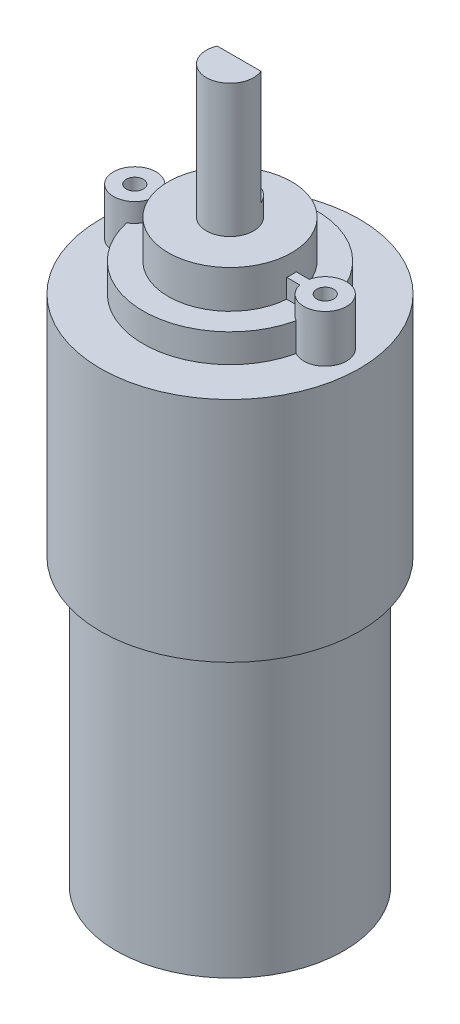
ISO-10303-21;
HEADER;
FILE_DESCRIPTION(('STEP AP214'),'2;1');
FILE_NAME('part.step','',(''),(''),'','','');
FILE_SCHEMA(('AUTOMOTIVE_DESIGN { 1 0 10303 214 1 1 1 1 }'));
ENDSEC;
DATA;
#1=APPLICATION_CONTEXT('core data for automotive mechanical design processes');
#2=APPLICATION_PROTOCOL_DEFINITION('international standard','automotive_design',2000,#1);
#3=PRODUCT_CONTEXT('',#1,'mechanical');
#4=PRODUCT('Part','Part','',(#3));
#5=PRODUCT_RELATED_PRODUCT_CATEGORY('part','',(#4));
#6=PRODUCT_DEFINITION_FORMATION('','',#4);
#7=PRODUCT_DEFINITION_CONTEXT('part definition',#1,'design');
#8=PRODUCT_DEFINITION('design','',#6,#7);
#9=PRODUCT_DEFINITION_SHAPE('','',#8);
#10=(LENGTH_UNIT() NAMED_UNIT(*) SI_UNIT(.MILLI.,.METRE.));
#11=(NAMED_UNIT(*) PLANE_ANGLE_UNIT() SI_UNIT($,.RADIAN.));
#12=(NAMED_UNIT(*) SI_UNIT($,.STERADIAN.) SOLID_ANGLE_UNIT());
#13=UNCERTAINTY_MEASURE_WITH_UNIT(LENGTH_MEASURE(1.E-05),#10,'distance_accuracy_value','');
#14=(GEOMETRIC_REPRESENTATION_CONTEXT(3) GLOBAL_UNCERTAINTY_ASSIGNED_CONTEXT((#13)) GLOBAL_UNIT_ASSIGNED_CONTEXT((#10,
#11,#12)) REPRESENTATION_CONTEXT('',''));
#15=CARTESIAN_POINT('',(0.,0.,0.));
#16=DIRECTION('',(0.,0.,1.));
#17=DIRECTION('',(1.,0.,0.));
#18=AXIS2_PLACEMENT_3D('',#15,#16,#17);
#19=CARTESIAN_POINT('',(0.,26.5,0.));
#20=DIRECTION('',(0.,1.,0.));
#21=DIRECTION('',(0.,0.,1.));
#22=AXIS2_PLACEMENT_3D('',#19,#20,#21);
#23=PLANE('',#22);
#24=DIRECTION('',(1.,0.,0.));
#25=VECTOR('',#24,1.);
#26=CARTESIAN_POINT('',(0.,26.5,0.500000000000004));
#27=LINE('',#26,#25);
#28=CARTESIAN_POINT('',(6.48074069840786,26.5,0.500000000000004));
#29=VERTEX_POINT('',#28);
#30=CARTESIAN_POINT('',(7.84625890315197,26.5,0.500000000000004));
#31=VERTEX_POINT('',#30);
#32=EDGE_CURVE('E169',#29,#31,#27,.T.);
#33=ORIENTED_EDGE('',*,*,#32,.F.);
#34=CARTESIAN_POINT('',(0.,26.5,0.));
#35=DIRECTION('',(0.,1.,0.));
#36=DIRECTION('',(0.,0.,1.));
#37=AXIS2_PLACEMENT_3D('',#34,#35,#36);
#38=CIRCLE('',#37,6.5);
#39=CARTESIAN_POINT('',(-6.48074069840786,26.5,0.500000000000004));
#40=VERTEX_POINT('',#39);
#41=EDGE_CURVE('E324',#40,#29,#38,.T.);
#42=ORIENTED_EDGE('',*,*,#41,.F.);
#43=CARTESIAN_POINT('',(-7.84625890315197,26.5,0.500000000000004));
#44=VERTEX_POINT('',#43);
#45=EDGE_CURVE('E359',#44,#40,#27,.T.);
#46=ORIENTED_EDGE('',*,*,#45,.F.);
#47=CARTESIAN_POINT('',(-10.04,26.5,0.));
#48=DIRECTION('',(0.,1.,0.));
#49=DIRECTION('',(0.,0.,1.));
#50=AXIS2_PLACEMENT_3D('',#47,#48,#49);
#51=CIRCLE('',#50,2.25);
#52=CARTESIAN_POINT('',(-8.93733067729084,26.5,1.96128028714819));
#53=VERTEX_POINT('',#52);
#54=EDGE_CURVE('E241',#44,#53,#51,.F.);
#55=ORIENTED_EDGE('',*,*,#54,.T.);
#56=CARTESIAN_POINT('',(0.,26.5,0.));
#57=DIRECTION('',(0.,1.,0.));
#58=DIRECTION('',(0.,0.,1.));
#59=AXIS2_PLACEMENT_3D('',#56,#57,#58);
#60=CIRCLE('',#59,9.15);
#61=CARTESIAN_POINT('',(8.93733067729083,26.5,1.9612802871482));
#62=VERTEX_POINT('',#61);
#63=EDGE_CURVE('E318',#53,#62,#60,.T.);
#64=ORIENTED_EDGE('',*,*,#63,.T.);
#65=CARTESIAN_POINT('',(10.04,26.5,0.));
#66=DIRECTION('',(0.,1.,0.));
#67=DIRECTION('',(0.,0.,1.));
#68=AXIS2_PLACEMENT_3D('',#65,#66,#67);
#69=CIRCLE('',#68,2.25);
#70=EDGE_CURVE('E261',#31,#62,#69,.T.);
#71=ORIENTED_EDGE('',*,*,#70,.F.);
#72=EDGE_LOOP('',(#33,#42,#46,#55,#64,#71));
#73=FACE_BOUND('',#72,.T.);
#74=ADVANCED_FACE('F41',(#73),#23,.T.);
#75=CARTESIAN_POINT('',(8.93733067729083,26.5,-1.9612802871482));
#76=VERTEX_POINT('',#75);
#77=CARTESIAN_POINT('',(7.84625890315197,26.5,-0.499999999999999));
#78=VERTEX_POINT('',#77);
#79=EDGE_CURVE('E265',#76,#78,#69,.T.);
#80=ORIENTED_EDGE('',*,*,#79,.F.);
#81=CARTESIAN_POINT('',(-8.93733067729083,26.5,-1.9612802871482));
#82=VERTEX_POINT('',#81);
#83=EDGE_CURVE('E386',#76,#82,#60,.T.);
#84=ORIENTED_EDGE('',*,*,#83,.T.);
#85=CARTESIAN_POINT('',(-7.84625890315197,26.5,-0.499999999999999));
#86=VERTEX_POINT('',#85);
#87=EDGE_CURVE('E236',#82,#86,#51,.F.);
#88=ORIENTED_EDGE('',*,*,#87,.T.);
#89=DIRECTION('',(1.,0.,0.));
#90=VECTOR('',#89,1.);
#91=CARTESIAN_POINT('',(0.,26.5,-0.499999999999999));
#92=LINE('',#91,#90);
#93=CARTESIAN_POINT('',(-6.48074069840786,26.5,-0.499999999999999));
#94=VERTEX_POINT('',#93);
#95=EDGE_CURVE('E356',#86,#94,#92,.T.);
#96=ORIENTED_EDGE('',*,*,#95,.T.);
#97=CARTESIAN_POINT('',(6.48074069840786,26.5,-0.499999999999999));
#98=VERTEX_POINT('',#97);
#99=EDGE_CURVE('E327',#98,#94,#38,.T.);
#100=ORIENTED_EDGE('',*,*,#99,.F.);
#101=EDGE_CURVE('E360',#98,#78,#92,.T.);
#102=ORIENTED_EDGE('',*,*,#101,.T.);
#103=EDGE_LOOP('',(#80,#84,#88,#96,#100,#102));
#104=FACE_BOUND('',#103,.T.);
#105=ADVANCED_FACE('F371',(#104),#23,.T.);
#106=CARTESIAN_POINT('',(0.,65.6871565633395,0.));
#107=DIRECTION('',(0.,1.,0.));
#108=DIRECTION('',(0.,0.,1.));
#109=AXIS2_PLACEMENT_3D('',#106,#107,#108);
#110=CYLINDRICAL_SURFACE('',#109,9.15);
#111=DIRECTION('',(0.,-1.,0.));
#112=VECTOR('',#111,1.);
#113=CARTESIAN_POINT('',(8.93733067729083,25.,-1.9612802871482));
#114=LINE('',#113,#112);
#115=CARTESIAN_POINT('',(8.93733067729083,23.5,-1.9612802871482));
#116=VERTEX_POINT('',#115);
#117=EDGE_CURVE('E264',#116,#76,#114,.F.);
#118=ORIENTED_EDGE('',*,*,#117,.F.);
#119=CARTESIAN_POINT('',(0.,23.5,0.));
#120=DIRECTION('',(0.,1.,0.));
#121=DIRECTION('',(0.,0.,1.));
#122=AXIS2_PLACEMENT_3D('',#119,#120,#121);
#123=CIRCLE('',#122,9.15);
#124=CARTESIAN_POINT('',(-8.93733067729083,23.5,-1.9612802871482));
#125=VERTEX_POINT('',#124);
#126=EDGE_CURVE('E392',#116,#125,#123,.T.);
#127=ORIENTED_EDGE('',*,*,#126,.T.);
#128=DIRECTION('',(0.,-1.,0.));
#129=VECTOR('',#128,1.);
#130=CARTESIAN_POINT('',(-8.93733067729083,25.,-1.9612802871482));
#131=LINE('',#130,#129);
#132=EDGE_CURVE('E232',#125,#82,#131,.F.);
#133=ORIENTED_EDGE('',*,*,#132,.T.);
#134=ORIENTED_EDGE('',*,*,#83,.F.);
#135=EDGE_LOOP('',(#118,#127,#133,#134));
#136=FACE_BOUND('',#135,.T.);
#137=ADVANCED_FACE('F435',(#136),#110,.T.);
#138=DIRECTION('',(0.,-1.,0.));
#139=VECTOR('',#138,1.);
#140=CARTESIAN_POINT('',(8.93733067729083,25.,1.9612802871482));
#141=LINE('',#140,#139);
#142=CARTESIAN_POINT('',(8.93733067729083,23.5,1.9612802871482));
#143=VERTEX_POINT('',#142);
#144=EDGE_CURVE('E257',#62,#143,#141,.T.);
#145=ORIENTED_EDGE('',*,*,#144,.F.);
#146=ORIENTED_EDGE('',*,*,#63,.F.);
#147=DIRECTION('',(0.,-1.,0.));
#148=VECTOR('',#147,1.);
#149=CARTESIAN_POINT('',(-8.93733067729083,25.,1.9612802871482));
#150=LINE('',#149,#148);
#151=CARTESIAN_POINT('',(-8.93733067729083,23.5,1.9612802871482));
#152=VERTEX_POINT('',#151);
#153=EDGE_CURVE('E240',#53,#152,#150,.T.);
#154=ORIENTED_EDGE('',*,*,#153,.T.);
#155=EDGE_CURVE('E312',#152,#143,#123,.T.);
#156=ORIENTED_EDGE('',*,*,#155,.T.);
#157=EDGE_LOOP('',(#145,#146,#154,#156));
#158=FACE_BOUND('',#157,.T.);
#159=ADVANCED_FACE('F404',(#158),#110,.T.);
#160=CARTESIAN_POINT('',(0.,23.5,0.));
#161=DIRECTION('',(0.,1.,0.));
#162=DIRECTION('',(0.,0.,1.));
#163=AXIS2_PLACEMENT_3D('',#160,#161,#162);
#164=PLANE('',#163);
#165=CARTESIAN_POINT('',(0.,23.5,0.));
#166=DIRECTION('',(0.,1.,0.));
#167=DIRECTION('',(0.,0.,1.));
#168=AXIS2_PLACEMENT_3D('',#165,#166,#167);
#169=CIRCLE('',#168,13.65);
#170=CARTESIAN_POINT('',(0.,23.5,13.65));
#171=VERTEX_POINT('',#170);
#172=EDGE_CURVE('E308',#171,#171,#169,.T.);
#173=ORIENTED_EDGE('',*,*,#172,.T.);
#174=EDGE_LOOP('',(#173));
#175=FACE_BOUND('',#174,.T.);
#176=CARTESIAN_POINT('',(10.04,23.5,0.));
#177=DIRECTION('',(0.,1.,0.));
#178=DIRECTION('',(0.,0.,1.));
#179=AXIS2_PLACEMENT_3D('',#176,#177,#178);
#180=CIRCLE('',#179,2.25);
#181=EDGE_CURVE('E352',#143,#116,#180,.T.);
#182=ORIENTED_EDGE('',*,*,#181,.F.);
#183=ORIENTED_EDGE('',*,*,#155,.F.);
#184=CARTESIAN_POINT('',(-10.04,23.5,0.));
#185=DIRECTION('',(0.,1.,0.));
#186=DIRECTION('',(0.,0.,1.));
#187=AXIS2_PLACEMENT_3D('',#184,#185,#186);
#188=CIRCLE('',#187,2.25);
#189=EDGE_CURVE('E344',#152,#125,#188,.F.);
#190=ORIENTED_EDGE('',*,*,#189,.T.);
#191=ORIENTED_EDGE('',*,*,#126,.F.);
#192=EDGE_LOOP('',(#182,#183,#190,#191));
#193=FACE_BOUND('',#192,.T.);
#194=ADVANCED_FACE('F465',(#175,#193),#164,.T.);
#195=CARTESIAN_POINT('',(0.,44.5,0.));
#196=DIRECTION('',(0.,1.,0.));
#197=DIRECTION('',(0.,0.,1.));
#198=AXIS2_PLACEMENT_3D('',#195,#196,#197);
#199=PLANE('',#198);
#200=DIRECTION('',(1.,0.,0.));
#201=VECTOR('',#200,1.);
#202=CARTESIAN_POINT('',(0.,44.5,-0.96));
#203=LINE('',#202,#201);
#204=CARTESIAN_POINT('',(-2.30833273164854,44.5,-0.96));
#205=VERTEX_POINT('',#204);
#206=CARTESIAN_POINT('',(2.30833273164854,44.5,-0.96));
#207=VERTEX_POINT('',#206);
#208=EDGE_CURVE('E280',#205,#207,#203,.T.);
#209=ORIENTED_EDGE('',*,*,#208,.F.);
#210=CARTESIAN_POINT('',(0.,44.5,0.));
#211=DIRECTION('',(0.,1.,0.));
#212=DIRECTION('',(0.,0.,1.));
#213=AXIS2_PLACEMENT_3D('',#210,#211,#212);
#214=CIRCLE('',#213,2.5);
#215=EDGE_CURVE('E336',#205,#207,#214,.T.);
#216=ORIENTED_EDGE('',*,*,#215,.T.);
#217=EDGE_LOOP('',(#209,#216));
#218=FACE_BOUND('',#217,.T.);
#219=ADVANCED_FACE('F43',(#218),#199,.T.);
#220=CARTESIAN_POINT('',(0.,65.6871565633395,0.));
#221=DIRECTION('',(0.,1.,0.));
#222=DIRECTION('',(0.,0.,1.));
#223=AXIS2_PLACEMENT_3D('',#220,#221,#222);
#224=CYLINDRICAL_SURFACE('',#223,2.5);
#225=DIRECTION('',(0.,1.,0.));
#226=VECTOR('',#225,1.);
#227=CARTESIAN_POINT('',(2.30833273164854,32.5,-0.96));
#228=LINE('',#227,#226);
#229=CARTESIAN_POINT('',(2.30833273164854,32.5,-0.96));
#230=VERTEX_POINT('',#229);
#231=EDGE_CURVE('E290',#230,#207,#228,.T.);
#232=ORIENTED_EDGE('',*,*,#231,.T.);
#233=ORIENTED_EDGE('',*,*,#215,.F.);
#234=DIRECTION('',(0.,1.,0.));
#235=VECTOR('',#234,1.);
#236=CARTESIAN_POINT('',(-2.30833273164854,32.5,-0.96));
#237=LINE('',#236,#235);
#238=CARTESIAN_POINT('',(-2.30833273164854,32.5,-0.96));
#239=VERTEX_POINT('',#238);
#240=EDGE_CURVE('E287',#239,#205,#237,.T.);
#241=ORIENTED_EDGE('',*,*,#240,.F.);
#242=CARTESIAN_POINT('',(0.,32.5,0.));
#243=DIRECTION('',(0.,1.,0.));
#244=DIRECTION('',(0.,0.,1.));
#245=AXIS2_PLACEMENT_3D('',#242,#243,#244);
#246=CIRCLE('',#245,2.5);
#247=EDGE_CURVE('E281',#230,#239,#246,.T.);
#248=ORIENTED_EDGE('',*,*,#247,.F.);
#249=EDGE_LOOP('',(#232,#233,#241,#248));
#250=FACE_BOUND('',#249,.T.);
#251=CARTESIAN_POINT('',(0.,30.5,0.));
#252=DIRECTION('',(0.,1.,0.));
#253=DIRECTION('',(0.,0.,1.));
#254=AXIS2_PLACEMENT_3D('',#251,#252,#253);
#255=CIRCLE('',#254,2.5);
#256=CARTESIAN_POINT('',(0.,30.5,2.5));
#257=VERTEX_POINT('',#256);
#258=EDGE_CURVE('E332',#257,#257,#255,.T.);
#259=ORIENTED_EDGE('',*,*,#258,.T.);
#260=EDGE_LOOP('',(#259));
#261=FACE_BOUND('',#260,.T.);
#262=ADVANCED_FACE('F541',(#250,#261),#224,.T.);
#263=CARTESIAN_POINT('',(0.,30.5,0.));
#264=DIRECTION('',(0.,1.,0.));
#265=DIRECTION('',(0.,0.,1.));
#266=AXIS2_PLACEMENT_3D('',#263,#264,#265);
#267=PLANE('',#266);
#268=CARTESIAN_POINT('',(0.,30.5,0.));
#269=DIRECTION('',(0.,1.,0.));
#270=DIRECTION('',(0.,0.,1.));
#271=AXIS2_PLACEMENT_3D('',#268,#269,#270);
#272=CIRCLE('',#271,6.5);
#273=CARTESIAN_POINT('',(0.,30.5,6.5));
#274=VERTEX_POINT('',#273);
#275=EDGE_CURVE('E328',#274,#274,#272,.T.);
#276=ORIENTED_EDGE('',*,*,#275,.T.);
#277=EDGE_LOOP('',(#276));
#278=FACE_BOUND('',#277,.T.);
#279=ORIENTED_EDGE('',*,*,#258,.F.);
#280=EDGE_LOOP('',(#279));
#281=FACE_BOUND('',#280,.T.);
#282=ADVANCED_FACE('F518',(#278,#281),#267,.T.);
#283=CARTESIAN_POINT('',(0.,65.6871565633395,0.));
#284=DIRECTION('',(0.,1.,0.));
#285=DIRECTION('',(0.,0.,1.));
#286=AXIS2_PLACEMENT_3D('',#283,#284,#285);
#287=CYLINDRICAL_SURFACE('',#286,6.5);
#288=DIRECTION('',(0.,1.,0.));
#289=VECTOR('',#288,1.);
#290=CARTESIAN_POINT('',(-6.48074069840786,65.6871565633395,0.500000000000004));
#291=LINE('',#290,#289);
#292=CARTESIAN_POINT('',(-6.48074069840786,28.5,0.500000000000004));
#293=VERTEX_POINT('',#292);
#294=EDGE_CURVE('E277',#40,#293,#291,.T.);
#295=ORIENTED_EDGE('',*,*,#294,.F.);
#296=ORIENTED_EDGE('',*,*,#41,.T.);
#297=DIRECTION('',(0.,1.,0.));
#298=VECTOR('',#297,1.);
#299=CARTESIAN_POINT('',(6.48074069840786,65.6871565633395,0.500000000000004));
#300=LINE('',#299,#298);
#301=CARTESIAN_POINT('',(6.48074069840786,28.5,0.500000000000004));
#302=VERTEX_POINT('',#301);
#303=EDGE_CURVE('E57',#302,#29,#300,.F.);
#304=ORIENTED_EDGE('',*,*,#303,.F.);
#305=CARTESIAN_POINT('',(0.,28.5,0.));
#306=DIRECTION('',(0.,1.,0.));
#307=DIRECTION('',(0.,0.,1.));
#308=AXIS2_PLACEMENT_3D('',#305,#306,#307);
#309=CIRCLE('',#308,6.5);
#310=CARTESIAN_POINT('',(6.48074069840786,28.5,-0.499999999999999));
#311=VERTEX_POINT('',#310);
#312=EDGE_CURVE('E45',#311,#302,#309,.F.);
#313=ORIENTED_EDGE('',*,*,#312,.F.);
#314=DIRECTION('',(0.,1.,0.));
#315=VECTOR('',#314,1.);
#316=CARTESIAN_POINT('',(6.48074069840786,65.6871565633395,-0.499999999999999));
#317=LINE('',#316,#315);
#318=EDGE_CURVE('E268',#311,#98,#317,.F.);
#319=ORIENTED_EDGE('',*,*,#318,.T.);
#320=ORIENTED_EDGE('',*,*,#99,.T.);
#321=DIRECTION('',(0.,1.,0.));
#322=VECTOR('',#321,1.);
#323=CARTESIAN_POINT('',(-6.48074069840786,65.6871565633395,-0.499999999999999));
#324=LINE('',#323,#322);
#325=CARTESIAN_POINT('',(-6.48074069840786,28.5,-0.499999999999999));
#326=VERTEX_POINT('',#325);
#327=EDGE_CURVE('E271',#94,#326,#324,.T.);
#328=ORIENTED_EDGE('',*,*,#327,.T.);
#329=EDGE_CURVE('E11',#293,#326,#309,.F.);
#330=ORIENTED_EDGE('',*,*,#329,.F.);
#331=EDGE_LOOP('',(#295,#296,#304,#313,#319,#320,#328,#330));
#332=FACE_BOUND('',#331,.T.);
#333=ORIENTED_EDGE('',*,*,#275,.F.);
#334=EDGE_LOOP('',(#333));
#335=FACE_BOUND('',#334,.T.);
#336=ADVANCED_FACE('F379',(#332,#335),#287,.T.);
#337=CARTESIAN_POINT('',(0.,65.6871565633395,0.));
#338=DIRECTION('',(0.,1.,0.));
#339=DIRECTION('',(0.,0.,1.));
#340=AXIS2_PLACEMENT_3D('',#337,#338,#339);
#341=CYLINDRICAL_SURFACE('',#340,13.65);
#342=CARTESIAN_POINT('',(0.,-0.5,0.));
#343=DIRECTION('',(0.,1.,0.));
#344=DIRECTION('',(0.,0.,1.));
#345=AXIS2_PLACEMENT_3D('',#342,#343,#344);
#346=CIRCLE('',#345,13.65);
#347=CARTESIAN_POINT('',(0.,-0.5,13.65));
#348=VERTEX_POINT('',#347);
#349=EDGE_CURVE('E304',#348,#348,#346,.T.);
#350=ORIENTED_EDGE('',*,*,#349,.T.);
#351=EDGE_LOOP('',(#350));
#352=FACE_BOUND('',#351,.T.);
#353=ORIENTED_EDGE('',*,*,#172,.F.);
#354=EDGE_LOOP('',(#353));
#355=FACE_BOUND('',#354,.T.);
#356=ADVANCED_FACE('F511',(#352,#355),#341,.T.);
#357=CARTESIAN_POINT('',(0.,-0.5,0.));
#358=DIRECTION('',(0.,-1.,0.));
#359=DIRECTION('',(0.,0.,-1.));
#360=AXIS2_PLACEMENT_3D('',#357,#358,#359);
#361=PLANE('',#360);
#362=CARTESIAN_POINT('',(0.,-0.5,0.));
#363=DIRECTION('',(0.,1.,0.));
#364=DIRECTION('',(0.,0.,1.));
#365=AXIS2_PLACEMENT_3D('',#362,#363,#364);
#366=CIRCLE('',#365,12.);
#367=CARTESIAN_POINT('',(0.,-0.5,12.));
#368=VERTEX_POINT('',#367);
#369=EDGE_CURVE('E300',#368,#368,#366,.T.);
#370=ORIENTED_EDGE('',*,*,#369,.T.);
#371=EDGE_LOOP('',(#370));
#372=FACE_BOUND('',#371,.T.);
#373=ORIENTED_EDGE('',*,*,#349,.F.);
#374=EDGE_LOOP('',(#373));
#375=FACE_BOUND('',#374,.T.);
#376=ADVANCED_FACE('F508',(#372,#375),#361,.T.);
#377=CARTESIAN_POINT('',(0.,65.6871565633395,0.));
#378=DIRECTION('',(0.,1.,0.));
#379=DIRECTION('',(0.,0.,1.));
#380=AXIS2_PLACEMENT_3D('',#377,#378,#379);
#381=CYLINDRICAL_SURFACE('',#380,12.);
#382=CARTESIAN_POINT('',(0.,-30.5,0.));
#383=DIRECTION('',(0.,1.,0.));
#384=DIRECTION('',(0.,0.,1.));
#385=AXIS2_PLACEMENT_3D('',#382,#383,#384);
#386=CIRCLE('',#385,12.);
#387=CARTESIAN_POINT('',(0.,-30.5,12.));
#388=VERTEX_POINT('',#387);
#389=EDGE_CURVE('E294',#388,#388,#386,.T.);
#390=ORIENTED_EDGE('',*,*,#389,.T.);
#391=EDGE_LOOP('',(#390));
#392=FACE_BOUND('',#391,.T.);
#393=ORIENTED_EDGE('',*,*,#369,.F.);
#394=EDGE_LOOP('',(#393));
#395=FACE_BOUND('',#394,.T.);
#396=ADVANCED_FACE('F504',(#392,#395),#381,.T.);
#397=CARTESIAN_POINT('',(0.,-30.5,0.));
#398=DIRECTION('',(0.,-1.,0.));
#399=DIRECTION('',(0.,0.,-1.));
#400=AXIS2_PLACEMENT_3D('',#397,#398,#399);
#401=PLANE('',#400);
#402=ORIENTED_EDGE('',*,*,#389,.F.);
#403=EDGE_LOOP('',(#402));
#404=FACE_BOUND('',#403,.T.);
#405=ADVANCED_FACE('F500',(#404),#401,.T.);
#406=CARTESIAN_POINT('',(0.,32.5,-0.96));
#407=DIRECTION('',(0.,0.,1.));
#408=DIRECTION('',(1.,0.,0.));
#409=AXIS2_PLACEMENT_3D('',#406,#407,#408);
#410=PLANE('',#409);
#411=ORIENTED_EDGE('',*,*,#208,.T.);
#412=ORIENTED_EDGE('',*,*,#231,.F.);
#413=DIRECTION('',(1.,0.,0.));
#414=VECTOR('',#413,1.);
#415=CARTESIAN_POINT('',(0.,32.5,-0.96));
#416=LINE('',#415,#414);
#417=EDGE_CURVE('E284',#239,#230,#416,.T.);
#418=ORIENTED_EDGE('',*,*,#417,.F.);
#419=ORIENTED_EDGE('',*,*,#240,.T.);
#420=EDGE_LOOP('',(#411,#412,#418,#419));
#421=FACE_BOUND('',#420,.T.);
#422=ADVANCED_FACE('F425',(#421),#410,.F.);
#423=CARTESIAN_POINT('',(0.,32.5,0.));
#424=DIRECTION('',(0.,1.,0.));
#425=DIRECTION('',(0.,0.,1.));
#426=AXIS2_PLACEMENT_3D('',#423,#424,#425);
#427=PLANE('',#426);
#428=ORIENTED_EDGE('',*,*,#247,.T.);
#429=ORIENTED_EDGE('',*,*,#417,.T.);
#430=EDGE_LOOP('',(#428,#429));
#431=FACE_BOUND('',#430,.T.);
#432=ADVANCED_FACE('F417',(#431),#427,.T.);
#433=CARTESIAN_POINT('',(-10.04,28.5,0.));
#434=DIRECTION('',(0.,-1.,0.));
#435=DIRECTION('',(0.,0.,-1.));
#436=AXIS2_PLACEMENT_3D('',#433,#434,#435);
#437=CYLINDRICAL_SURFACE('',#436,2.25);
#438=ORIENTED_EDGE('',*,*,#54,.F.);
#439=DIRECTION('',(0.,-1.,0.));
#440=VECTOR('',#439,1.);
#441=CARTESIAN_POINT('',(-7.84625890315197,28.5,0.500000000000004));
#442=LINE('',#441,#440);
#443=CARTESIAN_POINT('',(-7.84625890315197,28.5,0.500000000000004));
#444=VERTEX_POINT('',#443);
#445=EDGE_CURVE('E211',#444,#44,#442,.T.);
#446=ORIENTED_EDGE('',*,*,#445,.F.);
#447=CARTESIAN_POINT('',(-10.04,28.5,0.));
#448=DIRECTION('',(0.,1.,0.));
#449=DIRECTION('',(0.,0.,1.));
#450=AXIS2_PLACEMENT_3D('',#447,#448,#449);
#451=CIRCLE('',#450,2.25);
#452=CARTESIAN_POINT('',(-7.84625890315197,28.5,-0.499999999999999));
#453=VERTEX_POINT('',#452);
#454=EDGE_CURVE('E199',#453,#444,#451,.T.);
#455=ORIENTED_EDGE('',*,*,#454,.F.);
#456=DIRECTION('',(0.,-1.,0.));
#457=VECTOR('',#456,1.);
#458=CARTESIAN_POINT('',(-7.84625890315197,28.5,-0.499999999999999));
#459=LINE('',#458,#457);
#460=EDGE_CURVE('E215',#453,#86,#459,.T.);
#461=ORIENTED_EDGE('',*,*,#460,.T.);
#462=ORIENTED_EDGE('',*,*,#87,.F.);
#463=ORIENTED_EDGE('',*,*,#132,.F.);
#464=ORIENTED_EDGE('',*,*,#189,.F.);
#465=ORIENTED_EDGE('',*,*,#153,.F.);
#466=EDGE_LOOP('',(#438,#446,#455,#461,#462,#463,#464,#465));
#467=FACE_BOUND('',#466,.T.);
#468=ADVANCED_FACE('F414',(#467),#437,.T.);
#469=CARTESIAN_POINT('',(0.,28.5,-0.499999999999999));
#470=DIRECTION('',(0.,0.,1.));
#471=DIRECTION('',(1.,0.,0.));
#472=AXIS2_PLACEMENT_3D('',#469,#470,#471);
#473=PLANE('',#472);
#474=ORIENTED_EDGE('',*,*,#327,.F.);
#475=ORIENTED_EDGE('',*,*,#95,.F.);
#476=ORIENTED_EDGE('',*,*,#460,.F.);
#477=DIRECTION('',(-1.,0.,0.));
#478=VECTOR('',#477,1.);
#479=CARTESIAN_POINT('',(0.,28.5,-0.499999999999999));
#480=LINE('',#479,#478);
#481=EDGE_CURVE('E192',#326,#453,#480,.T.);
#482=ORIENTED_EDGE('',*,*,#481,.F.);
#483=EDGE_LOOP('',(#474,#475,#476,#482));
#484=FACE_BOUND('',#483,.T.);
#485=ADVANCED_FACE('F416',(#484),#473,.F.);
#486=CARTESIAN_POINT('',(0.,28.5,0.500000000000004));
#487=DIRECTION('',(0.,0.,1.));
#488=DIRECTION('',(1.,0.,0.));
#489=AXIS2_PLACEMENT_3D('',#486,#487,#488);
#490=PLANE('',#489);
#491=ORIENTED_EDGE('',*,*,#45,.T.);
#492=ORIENTED_EDGE('',*,*,#294,.T.);
#493=DIRECTION('',(-1.,0.,0.));
#494=VECTOR('',#493,1.);
#495=CARTESIAN_POINT('',(0.,28.5,0.500000000000004));
#496=LINE('',#495,#494);
#497=EDGE_CURVE('E184',#293,#444,#496,.T.);
#498=ORIENTED_EDGE('',*,*,#497,.T.);
#499=ORIENTED_EDGE('',*,*,#445,.T.);
#500=EDGE_LOOP('',(#491,#492,#498,#499));
#501=FACE_BOUND('',#500,.T.);
#502=ADVANCED_FACE('F407',(#501),#490,.T.);
#503=CARTESIAN_POINT('',(-10.04,28.5,0.));
#504=DIRECTION('',(0.,-1.,0.));
#505=DIRECTION('',(0.,0.,-1.));
#506=AXIS2_PLACEMENT_3D('',#503,#504,#505);
#507=CYLINDRICAL_SURFACE('',#506,0.9);
#508=CARTESIAN_POINT('',(-10.04,28.5,0.));
#509=DIRECTION('',(0.,1.,0.));
#510=DIRECTION('',(0.,0.,1.));
#511=AXIS2_PLACEMENT_3D('',#508,#509,#510);
#512=CIRCLE('',#511,0.9);
#513=CARTESIAN_POINT('',(-10.04,28.5,0.900000000000001));
#514=VERTEX_POINT('',#513);
#515=EDGE_CURVE('E207',#514,#514,#512,.T.);
#516=ORIENTED_EDGE('',*,*,#515,.T.);
#517=EDGE_LOOP('',(#516));
#518=FACE_BOUND('',#517,.T.);
#519=CARTESIAN_POINT('',(-10.04,26.5,0.));
#520=DIRECTION('',(0.,1.,0.));
#521=DIRECTION('',(0.,0.,1.));
#522=AXIS2_PLACEMENT_3D('',#519,#520,#521);
#523=CIRCLE('',#522,0.9);
#524=CARTESIAN_POINT('',(-9.14910856573705,26.5,-0.12772021123107));
#525=VERTEX_POINT('',#524);
#526=CARTESIAN_POINT('',(-9.14910856573705,26.5,0.127720211231075));
#527=VERTEX_POINT('',#526);
#528=EDGE_CURVE('E224',#525,#527,#523,.F.);
#529=ORIENTED_EDGE('',*,*,#528,.T.);
#530=DIRECTION('',(0.,-1.,0.));
#531=VECTOR('',#530,1.);
#532=CARTESIAN_POINT('',(-9.14910856573705,26.,0.127720211231075));
#533=LINE('',#532,#531);
#534=CARTESIAN_POINT('',(-9.14910856573705,23.5,0.127720211231075));
#535=VERTEX_POINT('',#534);
#536=EDGE_CURVE('E228',#527,#535,#533,.T.);
#537=ORIENTED_EDGE('',*,*,#536,.T.);
#538=CARTESIAN_POINT('',(-10.04,23.5,0.));
#539=DIRECTION('',(0.,1.,0.));
#540=DIRECTION('',(0.,0.,1.));
#541=AXIS2_PLACEMENT_3D('',#538,#539,#540);
#542=CIRCLE('',#541,0.9);
#543=CARTESIAN_POINT('',(-9.14910856573705,23.5,-0.127720211231072));
#544=VERTEX_POINT('',#543);
#545=EDGE_CURVE('E340',#535,#544,#542,.F.);
#546=ORIENTED_EDGE('',*,*,#545,.T.);
#547=DIRECTION('',(0.,-1.,0.));
#548=VECTOR('',#547,1.);
#549=CARTESIAN_POINT('',(-9.14910856573705,26.,-0.127720211231072));
#550=LINE('',#549,#548);
#551=EDGE_CURVE('E174',#544,#525,#550,.F.);
#552=ORIENTED_EDGE('',*,*,#551,.T.);
#553=EDGE_LOOP('',(#529,#537,#546,#552));
#554=FACE_BOUND('',#553,.T.);
#555=ADVANCED_FACE('F478',(#518,#554),#507,.F.);
#556=CARTESIAN_POINT('',(0.,28.5,0.));
#557=DIRECTION('',(0.,1.,0.));
#558=DIRECTION('',(0.,0.,1.));
#559=AXIS2_PLACEMENT_3D('',#556,#557,#558);
#560=PLANE('',#559);
#561=ORIENTED_EDGE('',*,*,#515,.F.);
#562=EDGE_LOOP('',(#561));
#563=FACE_BOUND('',#562,.T.);
#564=ORIENTED_EDGE('',*,*,#497,.F.);
#565=ORIENTED_EDGE('',*,*,#329,.T.);
#566=ORIENTED_EDGE('',*,*,#481,.T.);
#567=ORIENTED_EDGE('',*,*,#454,.T.);
#568=EDGE_LOOP('',(#564,#565,#566,#567));
#569=FACE_BOUND('',#568,.T.);
#570=ADVANCED_FACE('F409',(#563,#569),#560,.T.);
#571=ORIENTED_EDGE('',*,*,#545,.F.);
#572=EDGE_CURVE('E316',#544,#535,#123,.T.);
#573=ORIENTED_EDGE('',*,*,#572,.F.);
#574=EDGE_LOOP('',(#571,#573));
#575=FACE_BOUND('',#574,.T.);
#576=ADVANCED_FACE('F447',(#575),#164,.T.);
#577=ORIENTED_EDGE('',*,*,#536,.F.);
#578=EDGE_CURVE('E322',#525,#527,#60,.T.);
#579=ORIENTED_EDGE('',*,*,#578,.F.);
#580=ORIENTED_EDGE('',*,*,#551,.F.);
#581=ORIENTED_EDGE('',*,*,#572,.T.);
#582=EDGE_LOOP('',(#577,#579,#580,#581));
#583=FACE_BOUND('',#582,.T.);
#584=ADVANCED_FACE('F440',(#583),#110,.T.);
#585=ORIENTED_EDGE('',*,*,#528,.F.);
#586=ORIENTED_EDGE('',*,*,#578,.T.);
#587=EDGE_LOOP('',(#585,#586));
#588=FACE_BOUND('',#587,.T.);
#589=ADVANCED_FACE('F431',(#588),#23,.T.);
#590=CARTESIAN_POINT('',(7.84625890315197,28.5,0.500000000000004));
#591=VERTEX_POINT('',#590);
#592=EDGE_CURVE('E168',#591,#302,#496,.T.);
#593=ORIENTED_EDGE('',*,*,#592,.T.);
#594=ORIENTED_EDGE('',*,*,#303,.T.);
#595=ORIENTED_EDGE('',*,*,#32,.T.);
#596=DIRECTION('',(0.,-1.,0.));
#597=VECTOR('',#596,1.);
#598=CARTESIAN_POINT('',(7.84625890315197,28.5,0.500000000000004));
#599=LINE('',#598,#597);
#600=EDGE_CURVE('E165',#591,#31,#599,.T.);
#601=ORIENTED_EDGE('',*,*,#600,.F.);
#602=EDGE_LOOP('',(#593,#594,#595,#601));
#603=FACE_BOUND('',#602,.T.);
#604=ADVANCED_FACE('F167',(#603),#490,.T.);
#605=CARTESIAN_POINT('',(10.04,28.5,0.));
#606=DIRECTION('',(0.,-1.,0.));
#607=DIRECTION('',(0.,0.,-1.));
#608=AXIS2_PLACEMENT_3D('',#605,#606,#607);
#609=CYLINDRICAL_SURFACE('',#608,2.25);
#610=ORIENTED_EDGE('',*,*,#117,.T.);
#611=ORIENTED_EDGE('',*,*,#79,.T.);
#612=DIRECTION('',(0.,-1.,0.));
#613=VECTOR('',#612,1.);
#614=CARTESIAN_POINT('',(7.84625890315197,28.5,-0.499999999999999));
#615=LINE('',#614,#613);
#616=CARTESIAN_POINT('',(7.84625890315197,28.5,-0.499999999999999));
#617=VERTEX_POINT('',#616);
#618=EDGE_CURVE('E175',#617,#78,#615,.T.);
#619=ORIENTED_EDGE('',*,*,#618,.F.);
#620=CARTESIAN_POINT('',(10.04,28.5,0.));
#621=DIRECTION('',(0.,1.,0.));
#622=DIRECTION('',(0.,0.,1.));
#623=AXIS2_PLACEMENT_3D('',#620,#621,#622);
#624=CIRCLE('',#623,2.25);
#625=EDGE_CURVE('E182',#617,#591,#624,.F.);
#626=ORIENTED_EDGE('',*,*,#625,.T.);
#627=ORIENTED_EDGE('',*,*,#600,.T.);
#628=ORIENTED_EDGE('',*,*,#70,.T.);
#629=ORIENTED_EDGE('',*,*,#144,.T.);
#630=ORIENTED_EDGE('',*,*,#181,.T.);
#631=EDGE_LOOP('',(#610,#611,#619,#626,#627,#628,#629,#630));
#632=FACE_BOUND('',#631,.T.);
#633=ADVANCED_FACE('F187',(#632),#609,.T.);
#634=ORIENTED_EDGE('',*,*,#318,.F.);
#635=EDGE_CURVE('E195',#617,#311,#480,.T.);
#636=ORIENTED_EDGE('',*,*,#635,.F.);
#637=ORIENTED_EDGE('',*,*,#618,.T.);
#638=ORIENTED_EDGE('',*,*,#101,.F.);
#639=EDGE_LOOP('',(#634,#636,#637,#638));
#640=FACE_BOUND('',#639,.T.);
#641=ADVANCED_FACE('F378',(#640),#473,.F.);
#642=CARTESIAN_POINT('',(10.04,28.5,0.));
#643=DIRECTION('',(0.,-1.,0.));
#644=DIRECTION('',(0.,0.,-1.));
#645=AXIS2_PLACEMENT_3D('',#642,#643,#644);
#646=CYLINDRICAL_SURFACE('',#645,0.9);
#647=DIRECTION('',(0.,-1.,0.));
#648=VECTOR('',#647,1.);
#649=CARTESIAN_POINT('',(9.14910856573705,26.,-0.127720211231072));
#650=LINE('',#649,#648);
#651=CARTESIAN_POINT('',(9.14910856573705,23.5,-0.127720211231072));
#652=VERTEX_POINT('',#651);
#653=CARTESIAN_POINT('',(9.14910856573705,26.5,-0.127720211231072));
#654=VERTEX_POINT('',#653);
#655=EDGE_CURVE('E253',#652,#654,#650,.F.);
#656=ORIENTED_EDGE('',*,*,#655,.F.);
#657=CARTESIAN_POINT('',(10.04,23.5,0.));
#658=DIRECTION('',(0.,1.,0.));
#659=DIRECTION('',(0.,0.,1.));
#660=AXIS2_PLACEMENT_3D('',#657,#658,#659);
#661=CIRCLE('',#660,0.9);
#662=CARTESIAN_POINT('',(9.14910856573705,23.5,0.127720211231075));
#663=VERTEX_POINT('',#662);
#664=EDGE_CURVE('E348',#663,#652,#661,.T.);
#665=ORIENTED_EDGE('',*,*,#664,.F.);
#666=DIRECTION('',(0.,-1.,0.));
#667=VECTOR('',#666,1.);
#668=CARTESIAN_POINT('',(9.14910856573705,26.,0.127720211231075));
#669=LINE('',#668,#667);
#670=CARTESIAN_POINT('',(9.14910856573705,26.5,0.127720211231075));
#671=VERTEX_POINT('',#670);
#672=EDGE_CURVE('E245',#671,#663,#669,.T.);
#673=ORIENTED_EDGE('',*,*,#672,.F.);
#674=CARTESIAN_POINT('',(10.04,26.5,0.));
#675=DIRECTION('',(0.,1.,0.));
#676=DIRECTION('',(0.,0.,1.));
#677=AXIS2_PLACEMENT_3D('',#674,#675,#676);
#678=CIRCLE('',#677,0.9);
#679=EDGE_CURVE('E249',#654,#671,#678,.T.);
#680=ORIENTED_EDGE('',*,*,#679,.F.);
#681=EDGE_LOOP('',(#656,#665,#673,#680));
#682=FACE_BOUND('',#681,.T.);
#683=CARTESIAN_POINT('',(10.04,28.5,0.));
#684=DIRECTION('',(0.,1.,0.));
#685=DIRECTION('',(0.,0.,1.));
#686=AXIS2_PLACEMENT_3D('',#683,#684,#685);
#687=CIRCLE('',#686,0.9);
#688=CARTESIAN_POINT('',(10.04,28.5,0.900000000000001));
#689=VERTEX_POINT('',#688);
#690=EDGE_CURVE('E203',#689,#689,#687,.F.);
#691=ORIENTED_EDGE('',*,*,#690,.F.);
#692=EDGE_LOOP('',(#691));
#693=FACE_BOUND('',#692,.T.);
#694=ADVANCED_FACE('F460',(#682,#693),#646,.F.);
#695=ORIENTED_EDGE('',*,*,#635,.T.);
#696=ORIENTED_EDGE('',*,*,#312,.T.);
#697=ORIENTED_EDGE('',*,*,#592,.F.);
#698=ORIENTED_EDGE('',*,*,#625,.F.);
#699=EDGE_LOOP('',(#695,#696,#697,#698));
#700=FACE_BOUND('',#699,.T.);
#701=ORIENTED_EDGE('',*,*,#690,.T.);
#702=EDGE_LOOP('',(#701));
#703=FACE_BOUND('',#702,.T.);
#704=ADVANCED_FACE('F180',(#700,#703),#560,.T.);
#705=EDGE_CURVE('E317',#663,#652,#123,.T.);
#706=ORIENTED_EDGE('',*,*,#705,.F.);
#707=ORIENTED_EDGE('',*,*,#664,.T.);
#708=EDGE_LOOP('',(#706,#707));
#709=FACE_BOUND('',#708,.T.);
#710=ADVANCED_FACE('F455',(#709),#164,.T.);
#711=ORIENTED_EDGE('',*,*,#705,.T.);
#712=ORIENTED_EDGE('',*,*,#655,.T.);
#713=EDGE_CURVE('E323',#671,#654,#60,.T.);
#714=ORIENTED_EDGE('',*,*,#713,.F.);
#715=ORIENTED_EDGE('',*,*,#672,.T.);
#716=EDGE_LOOP('',(#711,#712,#714,#715));
#717=FACE_BOUND('',#716,.T.);
#718=ADVANCED_FACE('F449',(#717),#110,.T.);
#719=ORIENTED_EDGE('',*,*,#713,.T.);
#720=ORIENTED_EDGE('',*,*,#679,.T.);
#721=EDGE_LOOP('',(#719,#720));
#722=FACE_BOUND('',#721,.T.);
#723=ADVANCED_FACE('F436',(#722),#23,.T.);
#724=CLOSED_SHELL('',(#74,#105,#137,#159,#194,#219,#262,#282,#336,#356,#376,#396,#405,#422,#432,
#468,#485,#502,#555,#570,#576,#584,#589,#604,#633,#641,#694,#704,#710,#718,#723));
#725=MANIFOLD_SOLID_BREP('B2',#724);
#726=ADVANCED_BREP_SHAPE_REPRESENTATION('',(#18,#725),#14);
#727=SHAPE_DEFINITION_REPRESENTATION(#9,#726);
ENDSEC;
END-ISO-10303-21;
